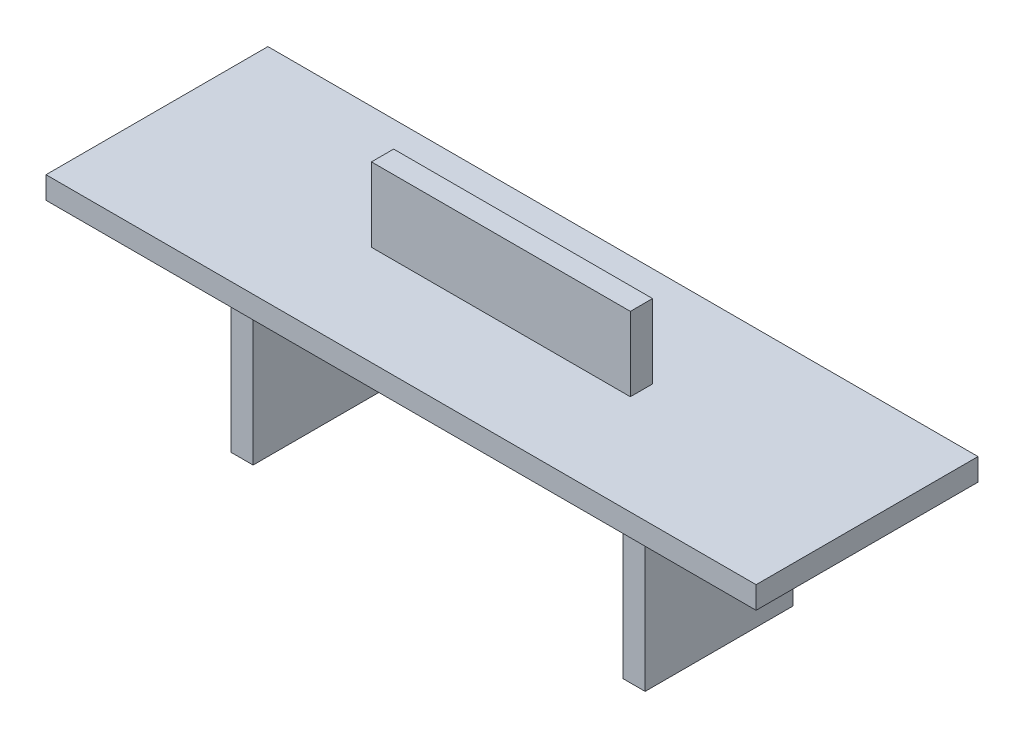
ISO-10303-21;
HEADER;
FILE_DESCRIPTION(('STEP AP214'),'2;1');
FILE_NAME('part.step','',(''),(''),'','','');
FILE_SCHEMA(('AUTOMOTIVE_DESIGN { 1 0 10303 214 1 1 1 1 }'));
ENDSEC;
DATA;
#1=APPLICATION_CONTEXT('core data for automotive mechanical design processes');
#2=APPLICATION_PROTOCOL_DEFINITION('international standard','automotive_design',2000,#1);
#3=PRODUCT_CONTEXT('',#1,'mechanical');
#4=PRODUCT('Part','Part','',(#3));
#5=PRODUCT_RELATED_PRODUCT_CATEGORY('part','',(#4));
#6=PRODUCT_DEFINITION_FORMATION('','',#4);
#7=PRODUCT_DEFINITION_CONTEXT('part definition',#1,'design');
#8=PRODUCT_DEFINITION('design','',#6,#7);
#9=PRODUCT_DEFINITION_SHAPE('','',#8);
#10=(LENGTH_UNIT() NAMED_UNIT(*) SI_UNIT(.MILLI.,.METRE.));
#11=(NAMED_UNIT(*) PLANE_ANGLE_UNIT() SI_UNIT($,.RADIAN.));
#12=(NAMED_UNIT(*) SI_UNIT($,.STERADIAN.) SOLID_ANGLE_UNIT());
#13=UNCERTAINTY_MEASURE_WITH_UNIT(LENGTH_MEASURE(1.E-05),#10,'distance_accuracy_value','');
#14=(GEOMETRIC_REPRESENTATION_CONTEXT(3) GLOBAL_UNCERTAINTY_ASSIGNED_CONTEXT((#13)) GLOBAL_UNIT_ASSIGNED_CONTEXT((#10,
#11,#12)) REPRESENTATION_CONTEXT('',''));
#15=CARTESIAN_POINT('',(0.,0.,0.));
#16=DIRECTION('',(0.,0.,1.));
#17=DIRECTION('',(1.,0.,0.));
#18=AXIS2_PLACEMENT_3D('',#15,#16,#17);
#19=CARTESIAN_POINT('',(-48.,2.99999999999999,30.));
#20=DIRECTION('',(0.,-1.,0.));
#21=DIRECTION('',(1.,0.,0.));
#22=AXIS2_PLACEMENT_3D('',#19,#20,#21);
#23=PLANE('',#22);
#24=DIRECTION('',(-1.,0.,0.));
#25=VECTOR('',#24,1.);
#26=CARTESIAN_POINT('',(-48.,2.99999999999999,0.));
#27=LINE('',#26,#25);
#28=CARTESIAN_POINT('',(48.,3.,0.));
#29=VERTEX_POINT('',#28);
#30=CARTESIAN_POINT('',(-48.,2.99999999999999,0.));
#31=VERTEX_POINT('',#30);
#32=EDGE_CURVE('E237',#29,#31,#27,.T.);
#33=ORIENTED_EDGE('',*,*,#32,.T.);
#34=DIRECTION('',(0.,0.,-1.));
#35=VECTOR('',#34,1.);
#36=CARTESIAN_POINT('',(-48.,2.99999999999999,30.));
#37=LINE('',#36,#35);
#38=CARTESIAN_POINT('',(-48.,2.99999999999999,30.));
#39=VERTEX_POINT('',#38);
#40=EDGE_CURVE('E246',#39,#31,#37,.T.);
#41=ORIENTED_EDGE('',*,*,#40,.F.);
#42=DIRECTION('',(-1.,0.,0.));
#43=VECTOR('',#42,1.);
#44=CARTESIAN_POINT('',(-48.,2.99999999999999,30.));
#45=LINE('',#44,#43);
#46=CARTESIAN_POINT('',(48.,3.,30.));
#47=VERTEX_POINT('',#46);
#48=EDGE_CURVE('E243',#47,#39,#45,.T.);
#49=ORIENTED_EDGE('',*,*,#48,.F.);
#50=DIRECTION('',(0.,0.,-1.));
#51=VECTOR('',#50,1.);
#52=CARTESIAN_POINT('',(48.,3.,30.));
#53=LINE('',#52,#51);
#54=EDGE_CURVE('E262',#47,#29,#53,.T.);
#55=ORIENTED_EDGE('',*,*,#54,.T.);
#56=EDGE_LOOP('',(#33,#41,#49,#55));
#57=FACE_BOUND('',#56,.T.);
#58=DIRECTION('',(0.,0.,-1.));
#59=VECTOR('',#58,1.);
#60=CARTESIAN_POINT('',(17.5,2.99999999999999,16.5));
#61=LINE('',#60,#59);
#62=CARTESIAN_POINT('',(17.5,2.99999999999999,16.5));
#63=VERTEX_POINT('',#62);
#64=CARTESIAN_POINT('',(17.5,2.99999999999999,13.5));
#65=VERTEX_POINT('',#64);
#66=EDGE_CURVE('E175',#63,#65,#61,.T.);
#67=ORIENTED_EDGE('',*,*,#66,.F.);
#68=DIRECTION('',(1.,0.,0.));
#69=VECTOR('',#68,1.);
#70=CARTESIAN_POINT('',(-17.5,2.99999999999999,16.5));
#71=LINE('',#70,#69);
#72=CARTESIAN_POINT('',(-17.5,2.99999999999999,16.5));
#73=VERTEX_POINT('',#72);
#74=EDGE_CURVE('E172',#73,#63,#71,.T.);
#75=ORIENTED_EDGE('',*,*,#74,.F.);
#76=DIRECTION('',(0.,0.,1.));
#77=VECTOR('',#76,1.);
#78=CARTESIAN_POINT('',(-17.5,2.99999999999999,16.5));
#79=LINE('',#78,#77);
#80=CARTESIAN_POINT('',(-17.5,2.99999999999999,13.5));
#81=VERTEX_POINT('',#80);
#82=EDGE_CURVE('E60',#81,#73,#79,.T.);
#83=ORIENTED_EDGE('',*,*,#82,.F.);
#84=DIRECTION('',(-1.,0.,0.));
#85=VECTOR('',#84,1.);
#86=CARTESIAN_POINT('',(-17.5,2.99999999999999,13.5));
#87=LINE('',#86,#85);
#88=EDGE_CURVE('E55',#65,#81,#87,.T.);
#89=ORIENTED_EDGE('',*,*,#88,.F.);
#90=EDGE_LOOP('',(#67,#75,#83,#89));
#91=FACE_BOUND('',#90,.T.);
#92=ADVANCED_FACE('F39',(#57,#91),#23,.F.);
#93=CARTESIAN_POINT('',(-48.,0.,30.));
#94=DIRECTION('',(1.,0.,0.));
#95=DIRECTION('',(0.,0.,-1.));
#96=AXIS2_PLACEMENT_3D('',#93,#94,#95);
#97=PLANE('',#96);
#98=DIRECTION('',(0.,-1.,0.));
#99=VECTOR('',#98,1.);
#100=CARTESIAN_POINT('',(-48.,0.,0.));
#101=LINE('',#100,#99);
#102=CARTESIAN_POINT('',(-48.,0.,0.));
#103=VERTEX_POINT('',#102);
#104=EDGE_CURVE('E231',#31,#103,#101,.T.);
#105=ORIENTED_EDGE('',*,*,#104,.T.);
#106=DIRECTION('',(0.,0.,-1.));
#107=VECTOR('',#106,1.);
#108=CARTESIAN_POINT('',(-48.,0.,30.));
#109=LINE('',#108,#107);
#110=CARTESIAN_POINT('',(-48.,0.,30.));
#111=VERTEX_POINT('',#110);
#112=EDGE_CURVE('E11',#111,#103,#109,.T.);
#113=ORIENTED_EDGE('',*,*,#112,.F.);
#114=DIRECTION('',(0.,-1.,0.));
#115=VECTOR('',#114,1.);
#116=CARTESIAN_POINT('',(-48.,0.,30.));
#117=LINE('',#116,#115);
#118=EDGE_CURVE('E232',#39,#111,#117,.T.);
#119=ORIENTED_EDGE('',*,*,#118,.F.);
#120=ORIENTED_EDGE('',*,*,#40,.T.);
#121=EDGE_LOOP('',(#105,#113,#119,#120));
#122=FACE_BOUND('',#121,.T.);
#123=ADVANCED_FACE('F41',(#122),#97,.F.);
#124=CARTESIAN_POINT('',(-28.,-22.,30.));
#125=DIRECTION('',(1.,0.,0.));
#126=DIRECTION('',(0.,0.,-1.));
#127=AXIS2_PLACEMENT_3D('',#124,#125,#126);
#128=PLANE('',#127);
#129=DIRECTION('',(0.,0.,-1.));
#130=VECTOR('',#129,1.);
#131=CARTESIAN_POINT('',(-28.,0.,30.));
#132=LINE('',#131,#130);
#133=CARTESIAN_POINT('',(-28.,0.,25.));
#134=VERTEX_POINT('',#133);
#135=CARTESIAN_POINT('',(-28.,0.,5.));
#136=VERTEX_POINT('',#135);
#137=EDGE_CURVE('E48',#134,#136,#132,.T.);
#138=ORIENTED_EDGE('',*,*,#137,.T.);
#139=DIRECTION('',(0.,1.,0.));
#140=VECTOR('',#139,1.);
#141=CARTESIAN_POINT('',(-28.,0.,5.));
#142=LINE('',#141,#140);
#143=CARTESIAN_POINT('',(-28.,-22.,5.));
#144=VERTEX_POINT('',#143);
#145=EDGE_CURVE('E187',#144,#136,#142,.T.);
#146=ORIENTED_EDGE('',*,*,#145,.F.);
#147=DIRECTION('',(0.,0.,-1.));
#148=VECTOR('',#147,1.);
#149=CARTESIAN_POINT('',(-28.,-22.,30.));
#150=LINE('',#149,#148);
#151=CARTESIAN_POINT('',(-28.,-22.,25.));
#152=VERTEX_POINT('',#151);
#153=EDGE_CURVE('E293',#152,#144,#150,.T.);
#154=ORIENTED_EDGE('',*,*,#153,.F.);
#155=DIRECTION('',(0.,-1.,0.));
#156=VECTOR('',#155,1.);
#157=CARTESIAN_POINT('',(-28.,0.,25.));
#158=LINE('',#157,#156);
#159=EDGE_CURVE('E177',#134,#152,#158,.T.);
#160=ORIENTED_EDGE('',*,*,#159,.F.);
#161=EDGE_LOOP('',(#138,#146,#154,#160));
#162=FACE_BOUND('',#161,.T.);
#163=ADVANCED_FACE('F302',(#162),#128,.F.);
#164=CARTESIAN_POINT('',(-25.,-22.,30.));
#165=DIRECTION('',(0.,1.,0.));
#166=DIRECTION('',(0.,0.,1.));
#167=AXIS2_PLACEMENT_3D('',#164,#165,#166);
#168=PLANE('',#167);
#169=ORIENTED_EDGE('',*,*,#153,.T.);
#170=DIRECTION('',(-1.,0.,0.));
#171=VECTOR('',#170,1.);
#172=CARTESIAN_POINT('',(48.,-22.,5.));
#173=LINE('',#172,#171);
#174=CARTESIAN_POINT('',(-25.,-22.,5.));
#175=VERTEX_POINT('',#174);
#176=EDGE_CURVE('E191',#175,#144,#173,.T.);
#177=ORIENTED_EDGE('',*,*,#176,.F.);
#178=DIRECTION('',(0.,0.,-1.));
#179=VECTOR('',#178,1.);
#180=CARTESIAN_POINT('',(-25.,-22.,30.));
#181=LINE('',#180,#179);
#182=CARTESIAN_POINT('',(-25.,-22.,25.));
#183=VERTEX_POINT('',#182);
#184=EDGE_CURVE('E289',#183,#175,#181,.T.);
#185=ORIENTED_EDGE('',*,*,#184,.F.);
#186=DIRECTION('',(-1.,0.,0.));
#187=VECTOR('',#186,1.);
#188=CARTESIAN_POINT('',(48.,-22.,25.));
#189=LINE('',#188,#187);
#190=EDGE_CURVE('E181',#183,#152,#189,.T.);
#191=ORIENTED_EDGE('',*,*,#190,.T.);
#192=EDGE_LOOP('',(#169,#177,#185,#191));
#193=FACE_BOUND('',#192,.T.);
#194=ADVANCED_FACE('F313',(#193),#168,.F.);
#195=CARTESIAN_POINT('',(-25.,0.,30.));
#196=DIRECTION('',(-1.,0.,0.));
#197=DIRECTION('',(0.,-1.,0.));
#198=AXIS2_PLACEMENT_3D('',#195,#196,#197);
#199=PLANE('',#198);
#200=ORIENTED_EDGE('',*,*,#184,.T.);
#201=DIRECTION('',(0.,1.,0.));
#202=VECTOR('',#201,1.);
#203=CARTESIAN_POINT('',(-25.,0.,5.));
#204=LINE('',#203,#202);
#205=CARTESIAN_POINT('',(-25.,0.,5.));
#206=VERTEX_POINT('',#205);
#207=EDGE_CURVE('E227',#175,#206,#204,.T.);
#208=ORIENTED_EDGE('',*,*,#207,.T.);
#209=DIRECTION('',(0.,0.,-1.));
#210=VECTOR('',#209,1.);
#211=CARTESIAN_POINT('',(-25.,0.,30.));
#212=LINE('',#211,#210);
#213=CARTESIAN_POINT('',(-25.,0.,25.));
#214=VERTEX_POINT('',#213);
#215=EDGE_CURVE('E285',#214,#206,#212,.T.);
#216=ORIENTED_EDGE('',*,*,#215,.F.);
#217=DIRECTION('',(0.,-1.,0.));
#218=VECTOR('',#217,1.);
#219=CARTESIAN_POINT('',(-25.,0.,25.));
#220=LINE('',#219,#218);
#221=EDGE_CURVE('E215',#214,#183,#220,.T.);
#222=ORIENTED_EDGE('',*,*,#221,.T.);
#223=EDGE_LOOP('',(#200,#208,#216,#222));
#224=FACE_BOUND('',#223,.T.);
#225=ADVANCED_FACE('F315',(#224),#199,.F.);
#226=CARTESIAN_POINT('',(25.,-22.,30.));
#227=DIRECTION('',(1.,0.,0.));
#228=DIRECTION('',(0.,1.,0.));
#229=AXIS2_PLACEMENT_3D('',#226,#227,#228);
#230=PLANE('',#229);
#231=DIRECTION('',(0.,0.,-1.));
#232=VECTOR('',#231,1.);
#233=CARTESIAN_POINT('',(25.,0.,30.));
#234=LINE('',#233,#232);
#235=CARTESIAN_POINT('',(25.,0.,25.));
#236=VERTEX_POINT('',#235);
#237=CARTESIAN_POINT('',(25.,0.,5.));
#238=VERTEX_POINT('',#237);
#239=EDGE_CURVE('E281',#236,#238,#234,.T.);
#240=ORIENTED_EDGE('',*,*,#239,.T.);
#241=DIRECTION('',(0.,-1.,0.));
#242=VECTOR('',#241,1.);
#243=CARTESIAN_POINT('',(25.,-22.,5.));
#244=LINE('',#243,#242);
#245=CARTESIAN_POINT('',(25.,-22.,5.));
#246=VERTEX_POINT('',#245);
#247=EDGE_CURVE('E223',#238,#246,#244,.T.);
#248=ORIENTED_EDGE('',*,*,#247,.T.);
#249=DIRECTION('',(0.,0.,-1.));
#250=VECTOR('',#249,1.);
#251=CARTESIAN_POINT('',(25.,-22.,30.));
#252=LINE('',#251,#250);
#253=CARTESIAN_POINT('',(25.,-22.,25.));
#254=VERTEX_POINT('',#253);
#255=EDGE_CURVE('E277',#254,#246,#252,.T.);
#256=ORIENTED_EDGE('',*,*,#255,.F.);
#257=DIRECTION('',(0.,1.,0.));
#258=VECTOR('',#257,1.);
#259=CARTESIAN_POINT('',(25.,-22.,25.));
#260=LINE('',#259,#258);
#261=EDGE_CURVE('E211',#254,#236,#260,.T.);
#262=ORIENTED_EDGE('',*,*,#261,.T.);
#263=EDGE_LOOP('',(#240,#248,#256,#262));
#264=FACE_BOUND('',#263,.T.);
#265=ADVANCED_FACE('F354',(#264),#230,.F.);
#266=CARTESIAN_POINT('',(28.,-22.,30.));
#267=DIRECTION('',(0.,1.,0.));
#268=DIRECTION('',(0.,0.,1.));
#269=AXIS2_PLACEMENT_3D('',#266,#267,#268);
#270=PLANE('',#269);
#271=ORIENTED_EDGE('',*,*,#255,.T.);
#272=CARTESIAN_POINT('',(28.,-22.,5.));
#273=VERTEX_POINT('',#272);
#274=EDGE_CURVE('E197',#273,#246,#173,.T.);
#275=ORIENTED_EDGE('',*,*,#274,.F.);
#276=DIRECTION('',(0.,0.,-1.));
#277=VECTOR('',#276,1.);
#278=CARTESIAN_POINT('',(28.,-22.,30.));
#279=LINE('',#278,#277);
#280=CARTESIAN_POINT('',(28.,-22.,25.));
#281=VERTEX_POINT('',#280);
#282=EDGE_CURVE('E273',#281,#273,#279,.T.);
#283=ORIENTED_EDGE('',*,*,#282,.F.);
#284=EDGE_CURVE('E203',#281,#254,#189,.T.);
#285=ORIENTED_EDGE('',*,*,#284,.T.);
#286=EDGE_LOOP('',(#271,#275,#283,#285));
#287=FACE_BOUND('',#286,.T.);
#288=ADVANCED_FACE('F350',(#287),#270,.F.);
#289=CARTESIAN_POINT('',(28.,0.,30.));
#290=DIRECTION('',(-1.,0.,0.));
#291=DIRECTION('',(0.,-1.,0.));
#292=AXIS2_PLACEMENT_3D('',#289,#290,#291);
#293=PLANE('',#292);
#294=ORIENTED_EDGE('',*,*,#282,.T.);
#295=DIRECTION('',(0.,1.,0.));
#296=VECTOR('',#295,1.);
#297=CARTESIAN_POINT('',(28.,0.,5.));
#298=LINE('',#297,#296);
#299=CARTESIAN_POINT('',(28.,0.,5.));
#300=VERTEX_POINT('',#299);
#301=EDGE_CURVE('E219',#273,#300,#298,.T.);
#302=ORIENTED_EDGE('',*,*,#301,.T.);
#303=DIRECTION('',(0.,0.,-1.));
#304=VECTOR('',#303,1.);
#305=CARTESIAN_POINT('',(28.,0.,30.));
#306=LINE('',#305,#304);
#307=CARTESIAN_POINT('',(28.,0.,25.));
#308=VERTEX_POINT('',#307);
#309=EDGE_CURVE('E269',#308,#300,#306,.T.);
#310=ORIENTED_EDGE('',*,*,#309,.F.);
#311=DIRECTION('',(0.,-1.,0.));
#312=VECTOR('',#311,1.);
#313=CARTESIAN_POINT('',(28.,0.,25.));
#314=LINE('',#313,#312);
#315=EDGE_CURVE('E207',#308,#281,#314,.T.);
#316=ORIENTED_EDGE('',*,*,#315,.T.);
#317=EDGE_LOOP('',(#294,#302,#310,#316));
#318=FACE_BOUND('',#317,.T.);
#319=ADVANCED_FACE('F346',(#318),#293,.F.);
#320=CARTESIAN_POINT('',(48.,0.,30.));
#321=DIRECTION('',(0.,1.,0.));
#322=DIRECTION('',(-1.,0.,0.));
#323=AXIS2_PLACEMENT_3D('',#320,#321,#322);
#324=PLANE('',#323);
#325=ORIENTED_EDGE('',*,*,#112,.T.);
#326=DIRECTION('',(1.,0.,0.));
#327=VECTOR('',#326,1.);
#328=CARTESIAN_POINT('',(48.,0.,0.));
#329=LINE('',#328,#327);
#330=CARTESIAN_POINT('',(48.,0.,0.));
#331=VERTEX_POINT('',#330);
#332=EDGE_CURVE('E250',#103,#331,#329,.T.);
#333=ORIENTED_EDGE('',*,*,#332,.T.);
#334=DIRECTION('',(0.,0.,-1.));
#335=VECTOR('',#334,1.);
#336=CARTESIAN_POINT('',(48.,0.,30.));
#337=LINE('',#336,#335);
#338=CARTESIAN_POINT('',(48.,0.,30.));
#339=VERTEX_POINT('',#338);
#340=EDGE_CURVE('E266',#339,#331,#337,.T.);
#341=ORIENTED_EDGE('',*,*,#340,.F.);
#342=DIRECTION('',(1.,0.,0.));
#343=VECTOR('',#342,1.);
#344=CARTESIAN_POINT('',(-28.,0.,30.));
#345=LINE('',#344,#343);
#346=EDGE_CURVE('E236',#111,#339,#345,.T.);
#347=ORIENTED_EDGE('',*,*,#346,.F.);
#348=EDGE_LOOP('',(#325,#333,#341,#347));
#349=FACE_BOUND('',#348,.T.);
#350=DIRECTION('',(-1.,0.,0.));
#351=VECTOR('',#350,1.);
#352=CARTESIAN_POINT('',(48.,0.,5.));
#353=LINE('',#352,#351);
#354=EDGE_CURVE('E196',#300,#238,#353,.T.);
#355=ORIENTED_EDGE('',*,*,#354,.T.);
#356=ORIENTED_EDGE('',*,*,#239,.F.);
#357=DIRECTION('',(-1.,0.,0.));
#358=VECTOR('',#357,1.);
#359=CARTESIAN_POINT('',(48.,0.,25.));
#360=LINE('',#359,#358);
#361=EDGE_CURVE('E192',#308,#236,#360,.T.);
#362=ORIENTED_EDGE('',*,*,#361,.F.);
#363=ORIENTED_EDGE('',*,*,#309,.T.);
#364=EDGE_LOOP('',(#355,#356,#362,#363));
#365=FACE_BOUND('',#364,.T.);
#366=ORIENTED_EDGE('',*,*,#215,.T.);
#367=EDGE_CURVE('E193',#206,#136,#353,.T.);
#368=ORIENTED_EDGE('',*,*,#367,.T.);
#369=ORIENTED_EDGE('',*,*,#137,.F.);
#370=EDGE_CURVE('E200',#214,#134,#360,.T.);
#371=ORIENTED_EDGE('',*,*,#370,.F.);
#372=EDGE_LOOP('',(#366,#368,#369,#371));
#373=FACE_BOUND('',#372,.T.);
#374=ADVANCED_FACE('F306',(#349,#365,#373),#324,.F.);
#375=CARTESIAN_POINT('',(48.,3.,30.));
#376=DIRECTION('',(-1.,0.,0.));
#377=DIRECTION('',(0.,0.,1.));
#378=AXIS2_PLACEMENT_3D('',#375,#376,#377);
#379=PLANE('',#378);
#380=DIRECTION('',(0.,1.,0.));
#381=VECTOR('',#380,1.);
#382=CARTESIAN_POINT('',(48.,3.,0.));
#383=LINE('',#382,#381);
#384=EDGE_CURVE('E254',#331,#29,#383,.T.);
#385=ORIENTED_EDGE('',*,*,#384,.T.);
#386=ORIENTED_EDGE('',*,*,#54,.F.);
#387=DIRECTION('',(0.,1.,0.));
#388=VECTOR('',#387,1.);
#389=CARTESIAN_POINT('',(48.,3.,30.));
#390=LINE('',#389,#388);
#391=EDGE_CURVE('E240',#339,#47,#390,.T.);
#392=ORIENTED_EDGE('',*,*,#391,.F.);
#393=ORIENTED_EDGE('',*,*,#340,.T.);
#394=EDGE_LOOP('',(#385,#386,#392,#393));
#395=FACE_BOUND('',#394,.T.);
#396=ADVANCED_FACE('F339',(#395),#379,.F.);
#397=CARTESIAN_POINT('',(0.,0.,30.));
#398=DIRECTION('',(0.,0.,-1.));
#399=DIRECTION('',(-1.,0.,0.));
#400=AXIS2_PLACEMENT_3D('',#397,#398,#399);
#401=PLANE('',#400);
#402=ORIENTED_EDGE('',*,*,#346,.T.);
#403=ORIENTED_EDGE('',*,*,#391,.T.);
#404=ORIENTED_EDGE('',*,*,#48,.T.);
#405=ORIENTED_EDGE('',*,*,#118,.T.);
#406=EDGE_LOOP('',(#402,#403,#404,#405));
#407=FACE_BOUND('',#406,.T.);
#408=ADVANCED_FACE('F342',(#407),#401,.F.);
#409=CARTESIAN_POINT('',(0.,0.,0.));
#410=DIRECTION('',(0.,0.,-1.));
#411=DIRECTION('',(-1.,0.,0.));
#412=AXIS2_PLACEMENT_3D('',#409,#410,#411);
#413=PLANE('',#412);
#414=ORIENTED_EDGE('',*,*,#332,.F.);
#415=ORIENTED_EDGE('',*,*,#104,.F.);
#416=ORIENTED_EDGE('',*,*,#32,.F.);
#417=ORIENTED_EDGE('',*,*,#384,.F.);
#418=EDGE_LOOP('',(#414,#415,#416,#417));
#419=FACE_BOUND('',#418,.T.);
#420=ADVANCED_FACE('F338',(#419),#413,.T.);
#421=CARTESIAN_POINT('',(48.,0.,5.));
#422=DIRECTION('',(0.,0.,1.));
#423=DIRECTION('',(0.,-1.,0.));
#424=AXIS2_PLACEMENT_3D('',#421,#422,#423);
#425=PLANE('',#424);
#426=ORIENTED_EDGE('',*,*,#354,.F.);
#427=ORIENTED_EDGE('',*,*,#301,.F.);
#428=ORIENTED_EDGE('',*,*,#274,.T.);
#429=ORIENTED_EDGE('',*,*,#247,.F.);
#430=EDGE_LOOP('',(#426,#427,#428,#429));
#431=FACE_BOUND('',#430,.T.);
#432=ADVANCED_FACE('F407',(#431),#425,.F.);
#433=ORIENTED_EDGE('',*,*,#176,.T.);
#434=ORIENTED_EDGE('',*,*,#145,.T.);
#435=ORIENTED_EDGE('',*,*,#367,.F.);
#436=ORIENTED_EDGE('',*,*,#207,.F.);
#437=EDGE_LOOP('',(#433,#434,#435,#436));
#438=FACE_BOUND('',#437,.T.);
#439=ADVANCED_FACE('F309',(#438),#425,.F.);
#440=CARTESIAN_POINT('',(48.,0.,25.));
#441=DIRECTION('',(0.,0.,-1.));
#442=DIRECTION('',(0.,1.,0.));
#443=AXIS2_PLACEMENT_3D('',#440,#441,#442);
#444=PLANE('',#443);
#445=ORIENTED_EDGE('',*,*,#284,.F.);
#446=ORIENTED_EDGE('',*,*,#315,.F.);
#447=ORIENTED_EDGE('',*,*,#361,.T.);
#448=ORIENTED_EDGE('',*,*,#261,.F.);
#449=EDGE_LOOP('',(#445,#446,#447,#448));
#450=FACE_BOUND('',#449,.T.);
#451=ADVANCED_FACE('F319',(#450),#444,.F.);
#452=ORIENTED_EDGE('',*,*,#370,.T.);
#453=ORIENTED_EDGE('',*,*,#159,.T.);
#454=ORIENTED_EDGE('',*,*,#190,.F.);
#455=ORIENTED_EDGE('',*,*,#221,.F.);
#456=EDGE_LOOP('',(#452,#453,#454,#455));
#457=FACE_BOUND('',#456,.T.);
#458=ADVANCED_FACE('F317',(#457),#444,.F.);
#459=CARTESIAN_POINT('',(17.5,13.,16.5));
#460=DIRECTION('',(-1.,0.,0.));
#461=DIRECTION('',(0.,-1.,0.));
#462=AXIS2_PLACEMENT_3D('',#459,#460,#461);
#463=PLANE('',#462);
#464=ORIENTED_EDGE('',*,*,#66,.T.);
#465=DIRECTION('',(0.,-1.,0.));
#466=VECTOR('',#465,1.);
#467=CARTESIAN_POINT('',(17.5,13.,13.5));
#468=LINE('',#467,#466);
#469=CARTESIAN_POINT('',(17.5,13.,13.5));
#470=VERTEX_POINT('',#469);
#471=EDGE_CURVE('E154',#470,#65,#468,.T.);
#472=ORIENTED_EDGE('',*,*,#471,.F.);
#473=DIRECTION('',(0.,0.,-1.));
#474=VECTOR('',#473,1.);
#475=CARTESIAN_POINT('',(17.5,13.,16.5));
#476=LINE('',#475,#474);
#477=CARTESIAN_POINT('',(17.5,13.,16.5));
#478=VERTEX_POINT('',#477);
#479=EDGE_CURVE('E162',#478,#470,#476,.T.);
#480=ORIENTED_EDGE('',*,*,#479,.F.);
#481=DIRECTION('',(0.,-1.,0.));
#482=VECTOR('',#481,1.);
#483=CARTESIAN_POINT('',(17.5,13.,16.5));
#484=LINE('',#483,#482);
#485=EDGE_CURVE('E479',#478,#63,#484,.T.);
#486=ORIENTED_EDGE('',*,*,#485,.T.);
#487=EDGE_LOOP('',(#464,#472,#480,#486));
#488=FACE_BOUND('',#487,.T.);
#489=ADVANCED_FACE('F174',(#488),#463,.F.);
#490=CARTESIAN_POINT('',(-17.5,13.,13.5));
#491=DIRECTION('',(0.,0.,1.));
#492=DIRECTION('',(1.,0.,0.));
#493=AXIS2_PLACEMENT_3D('',#490,#491,#492);
#494=PLANE('',#493);
#495=ORIENTED_EDGE('',*,*,#88,.T.);
#496=DIRECTION('',(0.,-1.,0.));
#497=VECTOR('',#496,1.);
#498=CARTESIAN_POINT('',(-17.5,13.,13.5));
#499=LINE('',#498,#497);
#500=CARTESIAN_POINT('',(-17.5,13.,13.5));
#501=VERTEX_POINT('',#500);
#502=EDGE_CURVE('E157',#501,#81,#499,.T.);
#503=ORIENTED_EDGE('',*,*,#502,.F.);
#504=DIRECTION('',(-1.,0.,0.));
#505=VECTOR('',#504,1.);
#506=CARTESIAN_POINT('',(-17.5,13.,13.5));
#507=LINE('',#506,#505);
#508=EDGE_CURVE('E150',#470,#501,#507,.T.);
#509=ORIENTED_EDGE('',*,*,#508,.F.);
#510=ORIENTED_EDGE('',*,*,#471,.T.);
#511=EDGE_LOOP('',(#495,#503,#509,#510));
#512=FACE_BOUND('',#511,.T.);
#513=ADVANCED_FACE('F152',(#512),#494,.F.);
#514=CARTESIAN_POINT('',(-17.5,13.,16.5));
#515=DIRECTION('',(1.,0.,0.));
#516=DIRECTION('',(0.,1.,0.));
#517=AXIS2_PLACEMENT_3D('',#514,#515,#516);
#518=PLANE('',#517);
#519=ORIENTED_EDGE('',*,*,#82,.T.);
#520=DIRECTION('',(0.,-1.,0.));
#521=VECTOR('',#520,1.);
#522=CARTESIAN_POINT('',(-17.5,13.,16.5));
#523=LINE('',#522,#521);
#524=CARTESIAN_POINT('',(-17.5,13.,16.5));
#525=VERTEX_POINT('',#524);
#526=EDGE_CURVE('E183',#525,#73,#523,.T.);
#527=ORIENTED_EDGE('',*,*,#526,.F.);
#528=DIRECTION('',(0.,0.,1.));
#529=VECTOR('',#528,1.);
#530=CARTESIAN_POINT('',(-17.5,13.,16.5));
#531=LINE('',#530,#529);
#532=EDGE_CURVE('E161',#501,#525,#531,.T.);
#533=ORIENTED_EDGE('',*,*,#532,.F.);
#534=ORIENTED_EDGE('',*,*,#502,.T.);
#535=EDGE_LOOP('',(#519,#527,#533,#534));
#536=FACE_BOUND('',#535,.T.);
#537=ADVANCED_FACE('F446',(#536),#518,.F.);
#538=CARTESIAN_POINT('',(-17.5,13.,16.5));
#539=DIRECTION('',(0.,0.,-1.));
#540=DIRECTION('',(-1.,0.,0.));
#541=AXIS2_PLACEMENT_3D('',#538,#539,#540);
#542=PLANE('',#541);
#543=ORIENTED_EDGE('',*,*,#74,.T.);
#544=ORIENTED_EDGE('',*,*,#485,.F.);
#545=DIRECTION('',(1.,0.,0.));
#546=VECTOR('',#545,1.);
#547=CARTESIAN_POINT('',(-17.5,13.,16.5));
#548=LINE('',#547,#546);
#549=EDGE_CURVE('E167',#525,#478,#548,.T.);
#550=ORIENTED_EDGE('',*,*,#549,.F.);
#551=ORIENTED_EDGE('',*,*,#526,.T.);
#552=EDGE_LOOP('',(#543,#544,#550,#551));
#553=FACE_BOUND('',#552,.T.);
#554=ADVANCED_FACE('F455',(#553),#542,.F.);
#555=CARTESIAN_POINT('',(0.,13.,0.));
#556=DIRECTION('',(0.,-1.,0.));
#557=DIRECTION('',(1.,0.,0.));
#558=AXIS2_PLACEMENT_3D('',#555,#556,#557);
#559=PLANE('',#558);
#560=ORIENTED_EDGE('',*,*,#479,.T.);
#561=ORIENTED_EDGE('',*,*,#508,.T.);
#562=ORIENTED_EDGE('',*,*,#532,.T.);
#563=ORIENTED_EDGE('',*,*,#549,.T.);
#564=EDGE_LOOP('',(#560,#561,#562,#563));
#565=FACE_BOUND('',#564,.T.);
#566=ADVANCED_FACE('F165',(#565),#559,.F.);
#567=CLOSED_SHELL('',(#92,#123,#163,#194,#225,#265,#288,#319,#374,#396,#408,#420,#432,#439,#451,
#458,#489,#513,#537,#554,#566));
#568=MANIFOLD_SOLID_BREP('B2',#567);
#569=ADVANCED_BREP_SHAPE_REPRESENTATION('',(#18,#568),#14);
#570=SHAPE_DEFINITION_REPRESENTATION(#9,#569);
ENDSEC;
END-ISO-10303-21;
